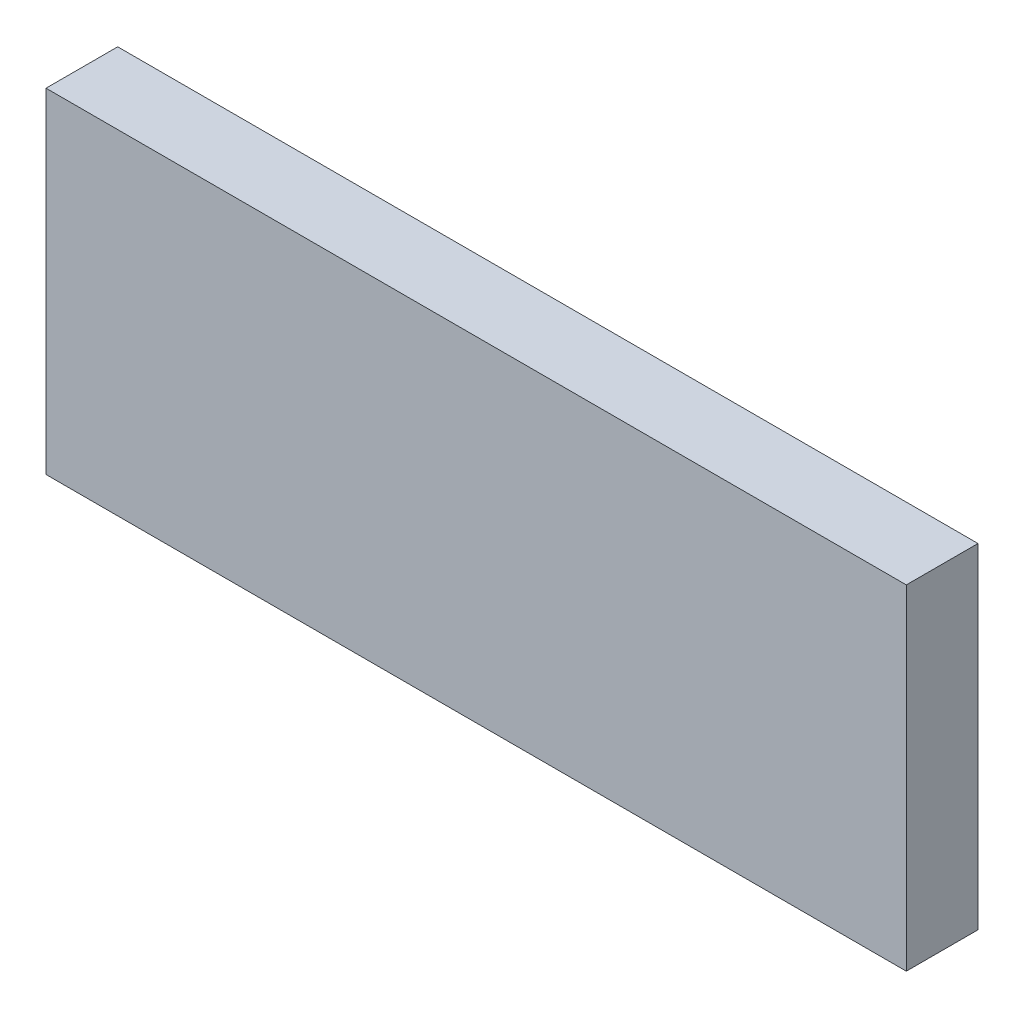
ISO-10303-21;
HEADER;
FILE_DESCRIPTION(('STEP AP214'),'2;1');
FILE_NAME('part.step','',(''),(''),'','','');
FILE_SCHEMA(('AUTOMOTIVE_DESIGN { 1 0 10303 214 1 1 1 1 }'));
ENDSEC;
DATA;
#1=APPLICATION_CONTEXT('core data for automotive mechanical design processes');
#2=APPLICATION_PROTOCOL_DEFINITION('international standard','automotive_design',2000,#1);
#3=PRODUCT_CONTEXT('',#1,'mechanical');
#4=PRODUCT('Part','Part','',(#3));
#5=PRODUCT_RELATED_PRODUCT_CATEGORY('part','',(#4));
#6=PRODUCT_DEFINITION_FORMATION('','',#4);
#7=PRODUCT_DEFINITION_CONTEXT('part definition',#1,'design');
#8=PRODUCT_DEFINITION('design','',#6,#7);
#9=PRODUCT_DEFINITION_SHAPE('','',#8);
#10=(LENGTH_UNIT() NAMED_UNIT(*) SI_UNIT(.MILLI.,.METRE.));
#11=(NAMED_UNIT(*) PLANE_ANGLE_UNIT() SI_UNIT($,.RADIAN.));
#12=(NAMED_UNIT(*) SI_UNIT($,.STERADIAN.) SOLID_ANGLE_UNIT());
#13=UNCERTAINTY_MEASURE_WITH_UNIT(LENGTH_MEASURE(1.E-05),#10,'distance_accuracy_value','');
#14=(GEOMETRIC_REPRESENTATION_CONTEXT(3) GLOBAL_UNCERTAINTY_ASSIGNED_CONTEXT((#13)) GLOBAL_UNIT_ASSIGNED_CONTEXT((#10,
#11,#12)) REPRESENTATION_CONTEXT('',''));
#15=CARTESIAN_POINT('',(0.,0.,0.));
#16=DIRECTION('',(0.,0.,1.));
#17=DIRECTION('',(1.,0.,0.));
#18=AXIS2_PLACEMENT_3D('',#15,#16,#17);
#19=CARTESIAN_POINT('',(0.,0.,0.));
#20=DIRECTION('',(0.,0.,-1.));
#21=DIRECTION('',(-1.,0.,0.));
#22=AXIS2_PLACEMENT_3D('',#19,#20,#21);
#23=PLANE('',#22);
#24=DIRECTION('',(0.,1.,0.));
#25=VECTOR('',#24,1.);
#26=CARTESIAN_POINT('',(-1.95,-1.15,0.));
#27=LINE('',#26,#25);
#28=CARTESIAN_POINT('',(-1.95,-1.85,0.));
#29=VERTEX_POINT('',#28);
#30=CARTESIAN_POINT('',(-1.95,-1.15,0.));
#31=VERTEX_POINT('',#30);
#32=EDGE_CURVE('E58',#29,#31,#27,.T.);
#33=ORIENTED_EDGE('',*,*,#32,.F.);
#34=DIRECTION('',(1.,0.,0.));
#35=VECTOR('',#34,1.);
#36=CARTESIAN_POINT('',(-1.95,-1.85,0.));
#37=LINE('',#36,#35);
#38=CARTESIAN_POINT('',(-3.75,-1.85,0.));
#39=VERTEX_POINT('',#38);
#40=EDGE_CURVE('E53',#39,#29,#37,.T.);
#41=ORIENTED_EDGE('',*,*,#40,.F.);
#42=DIRECTION('',(0.,1.,0.));
#43=VECTOR('',#42,1.);
#44=CARTESIAN_POINT('',(-3.75,0.,0.));
#45=LINE('',#44,#43);
#46=CARTESIAN_POINT('',(-3.75,-1.15,0.));
#47=VERTEX_POINT('',#46);
#48=EDGE_CURVE('E20',#39,#47,#45,.T.);
#49=ORIENTED_EDGE('',*,*,#48,.T.);
#50=DIRECTION('',(-1.,0.,0.));
#51=VECTOR('',#50,1.);
#52=CARTESIAN_POINT('',(-3.75,-1.15,0.));
#53=LINE('',#52,#51);
#54=EDGE_CURVE('E67',#31,#47,#53,.T.);
#55=ORIENTED_EDGE('',*,*,#54,.F.);
#56=EDGE_LOOP('',(#33,#41,#49,#55));
#57=FACE_BOUND('',#56,.T.);
#58=ADVANCED_FACE('F17',(#57),#23,.T.);
#59=CARTESIAN_POINT('',(-3.75,-1.15,0.15));
#60=DIRECTION('',(0.,1.,0.));
#61=DIRECTION('',(-1.,0.,0.));
#62=AXIS2_PLACEMENT_3D('',#59,#60,#61);
#63=PLANE('',#62);
#64=DIRECTION('',(-1.,0.,0.));
#65=VECTOR('',#64,1.);
#66=CARTESIAN_POINT('',(0.,-1.15,0.15));
#67=LINE('',#66,#65);
#68=CARTESIAN_POINT('',(-3.75,-1.15,0.15));
#69=VERTEX_POINT('',#68);
#70=CARTESIAN_POINT('',(-1.95,-1.15,0.15));
#71=VERTEX_POINT('',#70);
#72=EDGE_CURVE('E75',#69,#71,#67,.F.);
#73=ORIENTED_EDGE('',*,*,#72,.T.);
#74=DIRECTION('',(0.,0.,-1.));
#75=VECTOR('',#74,1.);
#76=CARTESIAN_POINT('',(-1.95,-1.15,0.15));
#77=LINE('',#76,#75);
#78=EDGE_CURVE('E63',#31,#71,#77,.F.);
#79=ORIENTED_EDGE('',*,*,#78,.F.);
#80=ORIENTED_EDGE('',*,*,#54,.T.);
#81=DIRECTION('',(0.,0.,1.));
#82=VECTOR('',#81,1.);
#83=CARTESIAN_POINT('',(-3.75,-1.15,0.15));
#84=LINE('',#83,#82);
#85=EDGE_CURVE('E81',#69,#47,#84,.F.);
#86=ORIENTED_EDGE('',*,*,#85,.F.);
#87=EDGE_LOOP('',(#73,#79,#80,#86));
#88=FACE_BOUND('',#87,.T.);
#89=ADVANCED_FACE('F74',(#88),#63,.T.);
#90=CARTESIAN_POINT('',(-1.95,-1.15,0.15));
#91=DIRECTION('',(1.,0.,0.));
#92=DIRECTION('',(0.,0.,-1.));
#93=AXIS2_PLACEMENT_3D('',#90,#91,#92);
#94=PLANE('',#93);
#95=DIRECTION('',(0.,1.,0.));
#96=VECTOR('',#95,1.);
#97=CARTESIAN_POINT('',(-1.95,0.,0.15));
#98=LINE('',#97,#96);
#99=CARTESIAN_POINT('',(-1.95,-1.85,0.15));
#100=VERTEX_POINT('',#99);
#101=EDGE_CURVE('E84',#71,#100,#98,.F.);
#102=ORIENTED_EDGE('',*,*,#101,.T.);
#103=DIRECTION('',(0.,0.,-1.));
#104=VECTOR('',#103,1.);
#105=CARTESIAN_POINT('',(-1.95,-1.85,0.15));
#106=LINE('',#105,#104);
#107=EDGE_CURVE('E65',#29,#100,#106,.F.);
#108=ORIENTED_EDGE('',*,*,#107,.F.);
#109=ORIENTED_EDGE('',*,*,#32,.T.);
#110=ORIENTED_EDGE('',*,*,#78,.T.);
#111=EDGE_LOOP('',(#102,#108,#109,#110));
#112=FACE_BOUND('',#111,.T.);
#113=ADVANCED_FACE('F61',(#112),#94,.T.);
#114=CARTESIAN_POINT('',(-1.95,-1.85,0.15));
#115=DIRECTION('',(0.,-1.,0.));
#116=DIRECTION('',(0.,0.,-1.));
#117=AXIS2_PLACEMENT_3D('',#114,#115,#116);
#118=PLANE('',#117);
#119=DIRECTION('',(-1.,0.,0.));
#120=VECTOR('',#119,1.);
#121=CARTESIAN_POINT('',(0.,-1.85,0.15));
#122=LINE('',#121,#120);
#123=CARTESIAN_POINT('',(-3.75,-1.85,0.15));
#124=VERTEX_POINT('',#123);
#125=EDGE_CURVE('E26',#100,#124,#122,.T.);
#126=ORIENTED_EDGE('',*,*,#125,.T.);
#127=DIRECTION('',(0.,0.,1.));
#128=VECTOR('',#127,1.);
#129=CARTESIAN_POINT('',(-3.75,-1.85,0.15));
#130=LINE('',#129,#128);
#131=EDGE_CURVE('E34',#39,#124,#130,.T.);
#132=ORIENTED_EDGE('',*,*,#131,.F.);
#133=ORIENTED_EDGE('',*,*,#40,.T.);
#134=ORIENTED_EDGE('',*,*,#107,.T.);
#135=EDGE_LOOP('',(#126,#132,#133,#134));
#136=FACE_BOUND('',#135,.T.);
#137=ADVANCED_FACE('F88',(#136),#118,.T.);
#138=CARTESIAN_POINT('',(-3.75,-1.85,0.15));
#139=DIRECTION('',(-1.,0.,0.));
#140=DIRECTION('',(0.,-1.,0.));
#141=AXIS2_PLACEMENT_3D('',#138,#139,#140);
#142=PLANE('',#141);
#143=DIRECTION('',(0.,1.,0.));
#144=VECTOR('',#143,1.);
#145=CARTESIAN_POINT('',(-3.75,0.,0.15));
#146=LINE('',#145,#144);
#147=EDGE_CURVE('E11',#124,#69,#146,.T.);
#148=ORIENTED_EDGE('',*,*,#147,.T.);
#149=ORIENTED_EDGE('',*,*,#85,.T.);
#150=ORIENTED_EDGE('',*,*,#48,.F.);
#151=ORIENTED_EDGE('',*,*,#131,.T.);
#152=EDGE_LOOP('',(#148,#149,#150,#151));
#153=FACE_BOUND('',#152,.T.);
#154=ADVANCED_FACE('F91',(#153),#142,.T.);
#155=CARTESIAN_POINT('',(0.,0.,0.15));
#156=DIRECTION('',(0.,0.,-1.));
#157=DIRECTION('',(-1.,0.,0.));
#158=AXIS2_PLACEMENT_3D('',#155,#156,#157);
#159=PLANE('',#158);
#160=ORIENTED_EDGE('',*,*,#125,.F.);
#161=ORIENTED_EDGE('',*,*,#101,.F.);
#162=ORIENTED_EDGE('',*,*,#72,.F.);
#163=ORIENTED_EDGE('',*,*,#147,.F.);
#164=EDGE_LOOP('',(#160,#161,#162,#163));
#165=FACE_BOUND('',#164,.T.);
#166=ADVANCED_FACE('F90',(#165),#159,.F.);
#167=CLOSED_SHELL('',(#58,#89,#113,#137,#154,#166));
#168=MANIFOLD_SOLID_BREP('B1',#167);
#169=ADVANCED_BREP_SHAPE_REPRESENTATION('',(#18,#168),#14);
#170=SHAPE_DEFINITION_REPRESENTATION(#9,#169);
ENDSEC;
END-ISO-10303-21;
